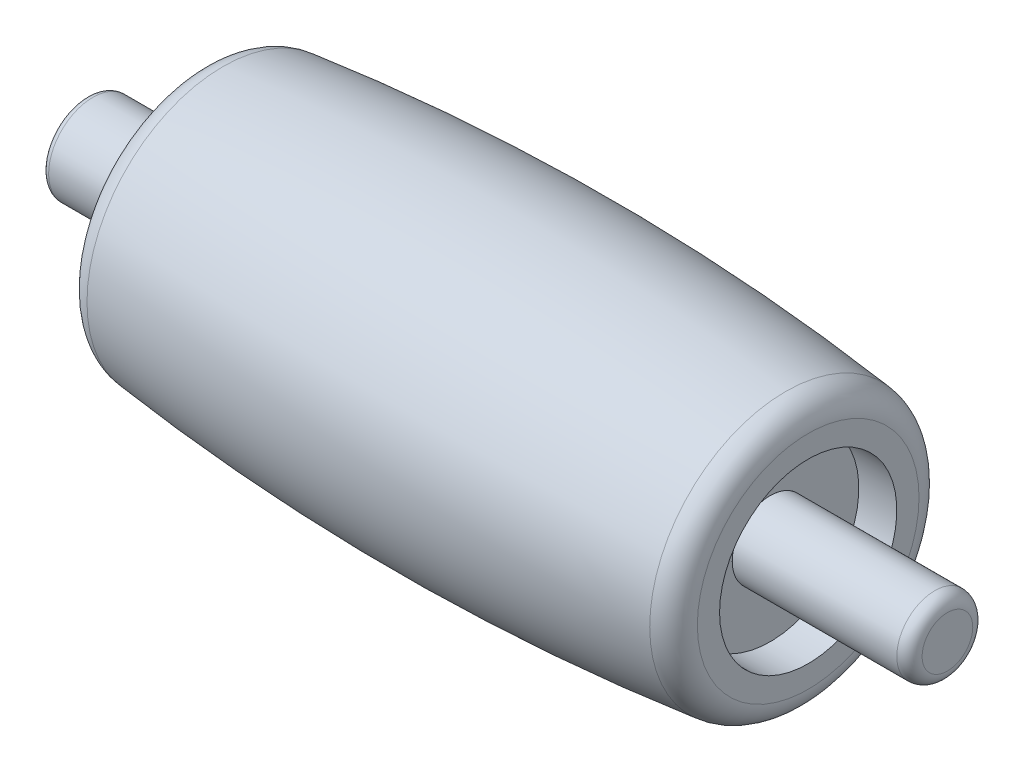
ISO-10303-21;
HEADER;
FILE_DESCRIPTION(('STEP AP214'),'2;1');
FILE_NAME('part.step','',(''),(''),'','','');
FILE_SCHEMA(('AUTOMOTIVE_DESIGN { 1 0 10303 214 1 1 1 1 }'));
ENDSEC;
DATA;
#1=APPLICATION_CONTEXT('core data for automotive mechanical design processes');
#2=APPLICATION_PROTOCOL_DEFINITION('international standard','automotive_design',2000,#1);
#3=PRODUCT_CONTEXT('',#1,'mechanical');
#4=PRODUCT('Part','Part','',(#3));
#5=PRODUCT_RELATED_PRODUCT_CATEGORY('part','',(#4));
#6=PRODUCT_DEFINITION_FORMATION('','',#4);
#7=PRODUCT_DEFINITION_CONTEXT('part definition',#1,'design');
#8=PRODUCT_DEFINITION('design','',#6,#7);
#9=PRODUCT_DEFINITION_SHAPE('','',#8);
#10=(LENGTH_UNIT() NAMED_UNIT(*) SI_UNIT(.MILLI.,.METRE.));
#11=(NAMED_UNIT(*) PLANE_ANGLE_UNIT() SI_UNIT($,.RADIAN.));
#12=(NAMED_UNIT(*) SI_UNIT($,.STERADIAN.) SOLID_ANGLE_UNIT());
#13=UNCERTAINTY_MEASURE_WITH_UNIT(LENGTH_MEASURE(1.E-05),#10,'distance_accuracy_value','');
#14=(GEOMETRIC_REPRESENTATION_CONTEXT(3) GLOBAL_UNCERTAINTY_ASSIGNED_CONTEXT((#13)) GLOBAL_UNIT_ASSIGNED_CONTEXT((#10,
#11,#12)) REPRESENTATION_CONTEXT('',''));
#15=CARTESIAN_POINT('',(0.,0.,0.));
#16=DIRECTION('',(0.,0.,1.));
#17=DIRECTION('',(1.,0.,0.));
#18=AXIS2_PLACEMENT_3D('',#15,#16,#17);
#19=CARTESIAN_POINT('',(-16.5,0.,0.));
#20=DIRECTION('',(1.,0.,0.));
#21=DIRECTION('',(0.,0.,-1.));
#22=AXIS2_PLACEMENT_3D('',#19,#20,#21);
#23=CYLINDRICAL_SURFACE('',#22,1.75);
#24=CARTESIAN_POINT('',(-16.25,0.,0.));
#25=DIRECTION('',(-1.,0.,0.));
#26=DIRECTION('',(0.,0.,1.));
#27=AXIS2_PLACEMENT_3D('',#24,#25,#26);
#28=CIRCLE('',#27,1.75);
#29=CARTESIAN_POINT('',(-16.25,0.,1.75));
#30=VERTEX_POINT('',#29);
#31=EDGE_CURVE('E11',#30,#30,#28,.F.);
#32=ORIENTED_EDGE('',*,*,#31,.T.);
#33=EDGE_LOOP('',(#32));
#34=FACE_BOUND('',#33,.T.);
#35=CARTESIAN_POINT('',(-10.5,0.,0.));
#36=DIRECTION('',(-1.,0.,0.));
#37=DIRECTION('',(0.,0.,1.));
#38=AXIS2_PLACEMENT_3D('',#35,#36,#37);
#39=CIRCLE('',#38,1.75);
#40=CARTESIAN_POINT('',(-10.5,0.,1.75));
#41=VERTEX_POINT('',#40);
#42=EDGE_CURVE('E56',#41,#41,#39,.T.);
#43=ORIENTED_EDGE('',*,*,#42,.T.);
#44=EDGE_LOOP('',(#43));
#45=FACE_BOUND('',#44,.T.);
#46=ADVANCED_FACE('F45',(#34,#45),#23,.T.);
#47=CARTESIAN_POINT('',(-16.5,0.,0.));
#48=DIRECTION('',(-1.,0.,0.));
#49=DIRECTION('',(0.,0.,1.));
#50=AXIS2_PLACEMENT_3D('',#47,#48,#49);
#51=PLANE('',#50);
#52=CARTESIAN_POINT('',(-16.5,0.,0.));
#53=DIRECTION('',(-1.,0.,0.));
#54=DIRECTION('',(0.,0.,1.));
#55=AXIS2_PLACEMENT_3D('',#52,#53,#54);
#56=CIRCLE('',#55,1.5);
#57=CARTESIAN_POINT('',(-16.5,0.,1.5));
#58=VERTEX_POINT('',#57);
#59=EDGE_CURVE('E52',#58,#58,#56,.T.);
#60=ORIENTED_EDGE('',*,*,#59,.T.);
#61=EDGE_LOOP('',(#60));
#62=FACE_BOUND('',#61,.T.);
#63=ADVANCED_FACE('F66',(#62),#51,.T.);
#64=CARTESIAN_POINT('',(-10.5,0.,0.));
#65=DIRECTION('',(-1.,0.,0.));
#66=DIRECTION('',(0.,0.,1.));
#67=AXIS2_PLACEMENT_3D('',#64,#65,#66);
#68=PLANE('',#67);
#69=ORIENTED_EDGE('',*,*,#42,.F.);
#70=EDGE_LOOP('',(#69));
#71=FACE_BOUND('',#70,.T.);
#72=ADVANCED_FACE('F64',(#71),#68,.F.);
#73=CARTESIAN_POINT('',(-16.25,0.,0.));
#74=DIRECTION('',(-1.,0.,0.));
#75=DIRECTION('',(0.,0.,1.));
#76=AXIS2_PLACEMENT_3D('',#73,#74,#75);
#77=TOROIDAL_SURFACE('',#76,1.5,0.25);
#78=ORIENTED_EDGE('',*,*,#31,.F.);
#79=EDGE_LOOP('',(#78));
#80=FACE_BOUND('',#79,.T.);
#81=ORIENTED_EDGE('',*,*,#59,.F.);
#82=EDGE_LOOP('',(#81));
#83=FACE_BOUND('',#82,.T.);
#84=ADVANCED_FACE('F47',(#80,#83),#77,.T.);
#85=CLOSED_SHELL('',(#46,#63,#72,#84));
#86=MANIFOLD_SOLID_BREP('B2',#85);
#87=CARTESIAN_POINT('',(17.5,0.,0.));
#88=DIRECTION('',(-1.,0.,0.));
#89=DIRECTION('',(0.,0.,1.));
#90=AXIS2_PLACEMENT_3D('',#87,#88,#89);
#91=CYLINDRICAL_SURFACE('',#90,1.5);
#92=CARTESIAN_POINT('',(17.,0.,0.));
#93=DIRECTION('',(1.,0.,0.));
#94=DIRECTION('',(0.,0.,-1.));
#95=AXIS2_PLACEMENT_3D('',#92,#93,#94);
#96=CIRCLE('',#95,1.5);
#97=CARTESIAN_POINT('',(17.,0.,-1.5));
#98=VERTEX_POINT('',#97);
#99=EDGE_CURVE('E44',#98,#98,#96,.F.);
#100=ORIENTED_EDGE('',*,*,#99,.T.);
#101=EDGE_LOOP('',(#100));
#102=FACE_BOUND('',#101,.T.);
#103=CARTESIAN_POINT('',(10.5,0.,0.));
#104=DIRECTION('',(1.,0.,0.));
#105=DIRECTION('',(0.,0.,-1.));
#106=AXIS2_PLACEMENT_3D('',#103,#104,#105);
#107=CIRCLE('',#106,1.5);
#108=CARTESIAN_POINT('',(10.5,0.,-1.5));
#109=VERTEX_POINT('',#108);
#110=EDGE_CURVE('E118',#109,#109,#107,.T.);
#111=ORIENTED_EDGE('',*,*,#110,.T.);
#112=EDGE_LOOP('',(#111));
#113=FACE_BOUND('',#112,.T.);
#114=ADVANCED_FACE('F107',(#102,#113),#91,.T.);
#115=CARTESIAN_POINT('',(17.5,0.,0.));
#116=DIRECTION('',(1.,0.,0.));
#117=DIRECTION('',(0.,0.,-1.));
#118=AXIS2_PLACEMENT_3D('',#115,#116,#117);
#119=PLANE('',#118);
#120=CARTESIAN_POINT('',(17.5,0.,0.));
#121=DIRECTION('',(1.,0.,0.));
#122=DIRECTION('',(0.,0.,-1.));
#123=AXIS2_PLACEMENT_3D('',#120,#121,#122);
#124=CIRCLE('',#123,1.);
#125=CARTESIAN_POINT('',(17.5,0.,-1.));
#126=VERTEX_POINT('',#125);
#127=EDGE_CURVE('E114',#126,#126,#124,.T.);
#128=ORIENTED_EDGE('',*,*,#127,.T.);
#129=EDGE_LOOP('',(#128));
#130=FACE_BOUND('',#129,.T.);
#131=ADVANCED_FACE('F128',(#130),#119,.T.);
#132=CARTESIAN_POINT('',(10.5,0.,0.));
#133=DIRECTION('',(1.,0.,0.));
#134=DIRECTION('',(0.,0.,-1.));
#135=AXIS2_PLACEMENT_3D('',#132,#133,#134);
#136=PLANE('',#135);
#137=ORIENTED_EDGE('',*,*,#110,.F.);
#138=EDGE_LOOP('',(#137));
#139=FACE_BOUND('',#138,.T.);
#140=ADVANCED_FACE('F126',(#139),#136,.F.);
#141=CARTESIAN_POINT('',(17.,0.,0.));
#142=DIRECTION('',(1.,0.,0.));
#143=DIRECTION('',(0.,0.,-1.));
#144=AXIS2_PLACEMENT_3D('',#141,#142,#143);
#145=TOROIDAL_SURFACE('',#144,1.,0.5);
#146=ORIENTED_EDGE('',*,*,#99,.F.);
#147=EDGE_LOOP('',(#146));
#148=FACE_BOUND('',#147,.T.);
#149=ORIENTED_EDGE('',*,*,#127,.F.);
#150=EDGE_LOOP('',(#149));
#151=FACE_BOUND('',#150,.T.);
#152=ADVANCED_FACE('F109',(#148,#151),#145,.T.);
#153=CLOSED_SHELL('',(#114,#131,#140,#152));
#154=MANIFOLD_SOLID_BREP('B6',#153);
#155=CARTESIAN_POINT('',(10.5,1.5,0.));
#156=DIRECTION('',(-1.,0.,0.));
#157=DIRECTION('',(0.,0.,1.));
#158=AXIS2_PLACEMENT_3D('',#155,#156,#157);
#159=PLANE('',#158);
#160=CARTESIAN_POINT('',(10.5,0.,0.));
#161=DIRECTION('',(-1.,0.,0.));
#162=DIRECTION('',(0.,0.,1.));
#163=AXIS2_PLACEMENT_3D('',#160,#161,#162);
#164=CIRCLE('',#163,3.5);
#165=CARTESIAN_POINT('',(10.5,0.,3.5));
#166=VERTEX_POINT('',#165);
#167=EDGE_CURVE('E106',#166,#166,#164,.T.);
#168=ORIENTED_EDGE('',*,*,#167,.F.);
#169=EDGE_LOOP('',(#168));
#170=FACE_BOUND('',#169,.T.);
#171=CARTESIAN_POINT('',(10.5,0.,0.));
#172=DIRECTION('',(-1.,0.,0.));
#173=DIRECTION('',(0.,0.,1.));
#174=AXIS2_PLACEMENT_3D('',#171,#172,#173);
#175=CIRCLE('',#174,1.5);
#176=CARTESIAN_POINT('',(10.5,0.,1.5));
#177=VERTEX_POINT('',#176);
#178=EDGE_CURVE('E197',#177,#177,#175,.T.);
#179=ORIENTED_EDGE('',*,*,#178,.T.);
#180=EDGE_LOOP('',(#179));
#181=FACE_BOUND('',#180,.T.);
#182=ADVANCED_FACE('F163',(#170,#181),#159,.F.);
#183=CARTESIAN_POINT('',(0.,0.,0.));
#184=DIRECTION('',(-1.,0.,0.));
#185=DIRECTION('',(0.,0.,1.));
#186=AXIS2_PLACEMENT_3D('',#183,#184,#185);
#187=CYLINDRICAL_SURFACE('',#186,3.5);
#188=CARTESIAN_POINT('',(12.,0.,0.));
#189=DIRECTION('',(-1.,0.,0.));
#190=DIRECTION('',(0.,0.,1.));
#191=AXIS2_PLACEMENT_3D('',#188,#189,#190);
#192=CIRCLE('',#191,3.5);
#193=CARTESIAN_POINT('',(12.,0.,3.5));
#194=VERTEX_POINT('',#193);
#195=EDGE_CURVE('E169',#194,#194,#192,.T.);
#196=ORIENTED_EDGE('',*,*,#195,.F.);
#197=EDGE_LOOP('',(#196));
#198=FACE_BOUND('',#197,.T.);
#199=ORIENTED_EDGE('',*,*,#167,.T.);
#200=EDGE_LOOP('',(#199));
#201=FACE_BOUND('',#200,.T.);
#202=ADVANCED_FACE('F246',(#198,#201),#187,.F.);
#203=CARTESIAN_POINT('',(12.,3.5,0.));
#204=DIRECTION('',(-1.,0.,0.));
#205=DIRECTION('',(0.,0.,1.));
#206=AXIS2_PLACEMENT_3D('',#203,#204,#205);
#207=PLANE('',#206);
#208=CARTESIAN_POINT('',(12.,0.,0.));
#209=DIRECTION('',(-1.,0.,0.));
#210=DIRECTION('',(0.,0.,1.));
#211=AXIS2_PLACEMENT_3D('',#208,#209,#210);
#212=CIRCLE('',#211,4.37749996774277);
#213=CARTESIAN_POINT('',(12.,0.,4.37749996774277));
#214=VERTEX_POINT('',#213);
#215=EDGE_CURVE('E173',#214,#214,#212,.T.);
#216=ORIENTED_EDGE('',*,*,#215,.F.);
#217=EDGE_LOOP('',(#216));
#218=FACE_BOUND('',#217,.T.);
#219=ORIENTED_EDGE('',*,*,#195,.T.);
#220=EDGE_LOOP('',(#219));
#221=FACE_BOUND('',#220,.T.);
#222=ADVANCED_FACE('F241',(#218,#221),#207,.F.);
#223=CARTESIAN_POINT('',(11.,0.,0.));
#224=DIRECTION('',(-1.,0.,0.));
#225=DIRECTION('',(0.,0.,1.));
#226=AXIS2_PLACEMENT_3D('',#223,#224,#225);
#227=TOROIDAL_SURFACE('',#226,4.37749996774277,1.00000000000001);
#228=CARTESIAN_POINT('',(11.1128205128205,0.,0.));
#229=DIRECTION('',(-1.,0.,0.));
#230=DIRECTION('',(0.,0.,1.));
#231=AXIS2_PLACEMENT_3D('',#228,#229,#230);
#232=CIRCLE('',#231,5.37111535202732);
#233=CARTESIAN_POINT('',(11.1128205128205,0.,5.37111535202732));
#234=VERTEX_POINT('',#233);
#235=EDGE_CURVE('E177',#234,#234,#232,.T.);
#236=ORIENTED_EDGE('',*,*,#235,.F.);
#237=EDGE_LOOP('',(#236));
#238=FACE_BOUND('',#237,.T.);
#239=ORIENTED_EDGE('',*,*,#215,.T.);
#240=EDGE_LOOP('',(#239));
#241=FACE_BOUND('',#240,.T.);
#242=ADVANCED_FACE('F235',(#238,#241),#227,.T.);
#243=CARTESIAN_POINT('',(0.,0.,0.));
#244=DIRECTION('',(-1.,0.,0.));
#245=DIRECTION('',(0.,0.,1.));
#246=AXIS2_PLACEMENT_3D('',#243,#244,#245);
#247=DEGENERATE_TOROIDAL_SURFACE('',#246,92.5000000000001,98.5000000000001,.F.);
#248=CARTESIAN_POINT('',(-11.1128205128205,0.,0.));
#249=DIRECTION('',(-1.,0.,0.));
#250=DIRECTION('',(0.,0.,1.));
#251=AXIS2_PLACEMENT_3D('',#248,#249,#250);
#252=CIRCLE('',#251,5.37111535202731);
#253=CARTESIAN_POINT('',(-11.1128205128205,0.,5.37111535202731));
#254=VERTEX_POINT('',#253);
#255=EDGE_CURVE('E182',#254,#254,#252,.T.);
#256=ORIENTED_EDGE('',*,*,#255,.F.);
#257=EDGE_LOOP('',(#256));
#258=FACE_BOUND('',#257,.T.);
#259=ORIENTED_EDGE('',*,*,#235,.T.);
#260=EDGE_LOOP('',(#259));
#261=FACE_BOUND('',#260,.T.);
#262=ADVANCED_FACE('F229',(#258,#261),#247,.F.);
#263=CARTESIAN_POINT('',(-11.,0.,0.));
#264=DIRECTION('',(-1.,0.,0.));
#265=DIRECTION('',(0.,0.,1.));
#266=AXIS2_PLACEMENT_3D('',#263,#264,#265);
#267=TOROIDAL_SURFACE('',#266,4.37749996774277,1.00000000000001);
#268=CARTESIAN_POINT('',(-12.,0.,0.));
#269=DIRECTION('',(-1.,0.,0.));
#270=DIRECTION('',(0.,0.,1.));
#271=AXIS2_PLACEMENT_3D('',#268,#269,#270);
#272=CIRCLE('',#271,4.37749996774277);
#273=CARTESIAN_POINT('',(-12.,0.,4.37749996774277));
#274=VERTEX_POINT('',#273);
#275=EDGE_CURVE('E185',#274,#274,#272,.T.);
#276=ORIENTED_EDGE('',*,*,#275,.F.);
#277=EDGE_LOOP('',(#276));
#278=FACE_BOUND('',#277,.T.);
#279=ORIENTED_EDGE('',*,*,#255,.T.);
#280=EDGE_LOOP('',(#279));
#281=FACE_BOUND('',#280,.T.);
#282=ADVANCED_FACE('F223',(#278,#281),#267,.T.);
#283=CARTESIAN_POINT('',(-12.,3.5,0.));
#284=DIRECTION('',(1.,0.,0.));
#285=DIRECTION('',(0.,0.,-1.));
#286=AXIS2_PLACEMENT_3D('',#283,#284,#285);
#287=PLANE('',#286);
#288=CARTESIAN_POINT('',(-12.,0.,0.));
#289=DIRECTION('',(-1.,0.,0.));
#290=DIRECTION('',(0.,0.,1.));
#291=AXIS2_PLACEMENT_3D('',#288,#289,#290);
#292=CIRCLE('',#291,3.5);
#293=CARTESIAN_POINT('',(-12.,0.,3.5));
#294=VERTEX_POINT('',#293);
#295=EDGE_CURVE('E188',#294,#294,#292,.T.);
#296=ORIENTED_EDGE('',*,*,#295,.F.);
#297=EDGE_LOOP('',(#296));
#298=FACE_BOUND('',#297,.T.);
#299=ORIENTED_EDGE('',*,*,#275,.T.);
#300=EDGE_LOOP('',(#299));
#301=FACE_BOUND('',#300,.T.);
#302=ADVANCED_FACE('F217',(#298,#301),#287,.F.);
#303=CARTESIAN_POINT('',(0.,0.,0.));
#304=DIRECTION('',(-1.,0.,0.));
#305=DIRECTION('',(0.,0.,1.));
#306=AXIS2_PLACEMENT_3D('',#303,#304,#305);
#307=CYLINDRICAL_SURFACE('',#306,3.5);
#308=CARTESIAN_POINT('',(-10.5,0.,0.));
#309=DIRECTION('',(-1.,0.,0.));
#310=DIRECTION('',(0.,0.,1.));
#311=AXIS2_PLACEMENT_3D('',#308,#309,#310);
#312=CIRCLE('',#311,3.5);
#313=CARTESIAN_POINT('',(-10.5,0.,3.5));
#314=VERTEX_POINT('',#313);
#315=EDGE_CURVE('E191',#314,#314,#312,.T.);
#316=ORIENTED_EDGE('',*,*,#315,.F.);
#317=EDGE_LOOP('',(#316));
#318=FACE_BOUND('',#317,.T.);
#319=ORIENTED_EDGE('',*,*,#295,.T.);
#320=EDGE_LOOP('',(#319));
#321=FACE_BOUND('',#320,.T.);
#322=ADVANCED_FACE('F211',(#318,#321),#307,.F.);
#323=CARTESIAN_POINT('',(-10.5,1.5,0.));
#324=DIRECTION('',(1.,0.,0.));
#325=DIRECTION('',(0.,0.,-1.));
#326=AXIS2_PLACEMENT_3D('',#323,#324,#325);
#327=PLANE('',#326);
#328=CARTESIAN_POINT('',(-10.5,0.,0.));
#329=DIRECTION('',(-1.,0.,0.));
#330=DIRECTION('',(0.,0.,1.));
#331=AXIS2_PLACEMENT_3D('',#328,#329,#330);
#332=CIRCLE('',#331,1.5);
#333=CARTESIAN_POINT('',(-10.5,0.,1.5));
#334=VERTEX_POINT('',#333);
#335=EDGE_CURVE('E194',#334,#334,#332,.T.);
#336=ORIENTED_EDGE('',*,*,#335,.F.);
#337=EDGE_LOOP('',(#336));
#338=FACE_BOUND('',#337,.T.);
#339=ORIENTED_EDGE('',*,*,#315,.T.);
#340=EDGE_LOOP('',(#339));
#341=FACE_BOUND('',#340,.T.);
#342=ADVANCED_FACE('F205',(#338,#341),#327,.F.);
#343=CARTESIAN_POINT('',(0.,0.,0.));
#344=DIRECTION('',(-1.,0.,0.));
#345=DIRECTION('',(0.,0.,1.));
#346=AXIS2_PLACEMENT_3D('',#343,#344,#345);
#347=CYLINDRICAL_SURFACE('',#346,1.5);
#348=ORIENTED_EDGE('',*,*,#178,.F.);
#349=EDGE_LOOP('',(#348));
#350=FACE_BOUND('',#349,.T.);
#351=ORIENTED_EDGE('',*,*,#335,.T.);
#352=EDGE_LOOP('',(#351));
#353=FACE_BOUND('',#352,.T.);
#354=ADVANCED_FACE('F202',(#350,#353),#347,.F.);
#355=CLOSED_SHELL('',(#182,#202,#222,#242,#262,#282,#302,#322,#342,#354));
#356=MANIFOLD_SOLID_BREP('B39',#355);
#357=ADVANCED_BREP_SHAPE_REPRESENTATION('',(#18,#86,#154,#356),#14);
#358=SHAPE_DEFINITION_REPRESENTATION(#9,#357);
ENDSEC;
END-ISO-10303-21;
